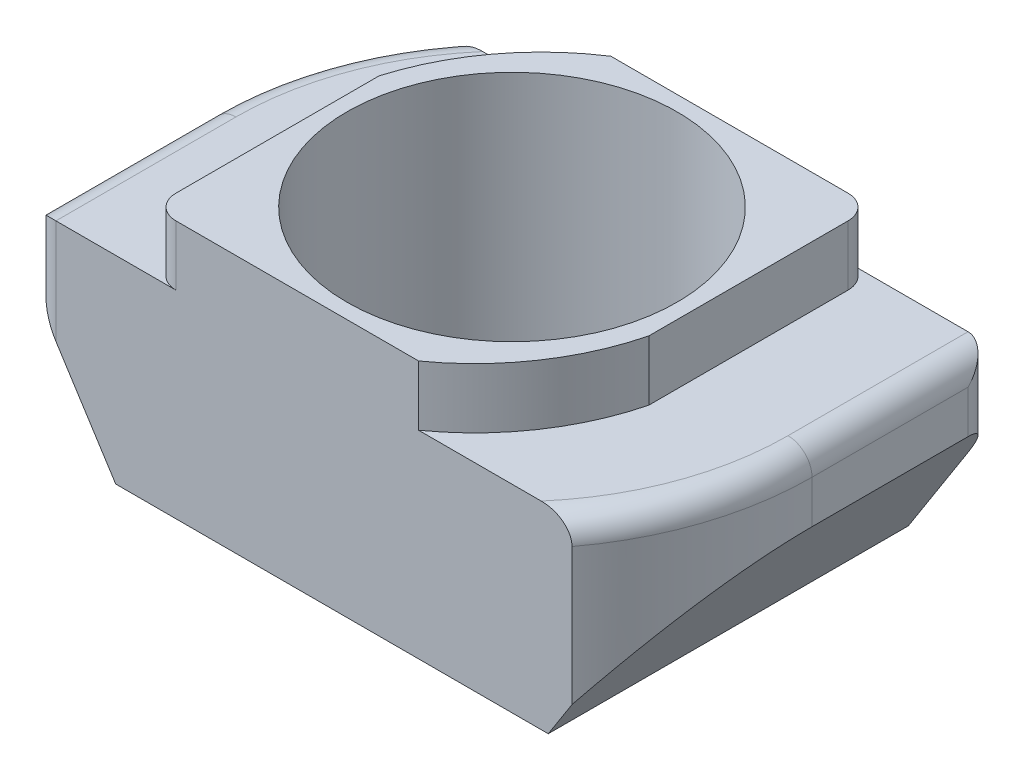
ISO-10303-21;
HEADER;
FILE_DESCRIPTION(('STEP AP214'),'2;1');
FILE_NAME('part.step','',(''),(''),'','','');
FILE_SCHEMA(('AUTOMOTIVE_DESIGN { 1 0 10303 214 1 1 1 1 }'));
ENDSEC;
DATA;
#1=APPLICATION_CONTEXT('core data for automotive mechanical design processes');
#2=APPLICATION_PROTOCOL_DEFINITION('international standard','automotive_design',2000,#1);
#3=PRODUCT_CONTEXT('',#1,'mechanical');
#4=PRODUCT('Part','Part','',(#3));
#5=PRODUCT_RELATED_PRODUCT_CATEGORY('part','',(#4));
#6=PRODUCT_DEFINITION_FORMATION('','',#4);
#7=PRODUCT_DEFINITION_CONTEXT('part definition',#1,'design');
#8=PRODUCT_DEFINITION('design','',#6,#7);
#9=PRODUCT_DEFINITION_SHAPE('','',#8);
#10=(LENGTH_UNIT() NAMED_UNIT(*) SI_UNIT(.MILLI.,.METRE.));
#11=(NAMED_UNIT(*) PLANE_ANGLE_UNIT() SI_UNIT($,.RADIAN.));
#12=(NAMED_UNIT(*) SI_UNIT($,.STERADIAN.) SOLID_ANGLE_UNIT());
#13=UNCERTAINTY_MEASURE_WITH_UNIT(LENGTH_MEASURE(1.E-05),#10,'distance_accuracy_value','');
#14=(GEOMETRIC_REPRESENTATION_CONTEXT(3) GLOBAL_UNCERTAINTY_ASSIGNED_CONTEXT((#13)) GLOBAL_UNIT_ASSIGNED_CONTEXT((#10,
#11,#12)) REPRESENTATION_CONTEXT('',''));
#15=CARTESIAN_POINT('',(0.,0.,0.));
#16=DIRECTION('',(0.,0.,1.));
#17=DIRECTION('',(1.,0.,0.));
#18=AXIS2_PLACEMENT_3D('',#15,#16,#17);
#19=CARTESIAN_POINT('',(0.,3.3,0.));
#20=DIRECTION('',(0.,1.,0.));
#21=DIRECTION('',(0.,0.,1.));
#22=AXIS2_PLACEMENT_3D('',#19,#20,#21);
#23=PLANE('',#22);
#24=DIRECTION('',(1.,0.,0.));
#25=VECTOR('',#24,1.);
#26=CARTESIAN_POINT('',(-5.,3.3,3.));
#27=LINE('',#26,#25);
#28=CARTESIAN_POINT('',(1.44349602110728,3.3,3.00000000000006));
#29=VERTEX_POINT('',#28);
#30=CARTESIAN_POINT('',(3.48711915483249,3.3,3.00000000000008));
#31=VERTEX_POINT('',#30);
#32=EDGE_CURVE('E427',#29,#31,#27,.T.);
#33=ORIENTED_EDGE('',*,*,#32,.T.);
#34=CARTESIAN_POINT('',(0.,3.3,0.));
#35=DIRECTION('',(0.,1.,0.));
#36=DIRECTION('',(0.,0.,1.));
#37=AXIS2_PLACEMENT_3D('',#34,#35,#36);
#38=CIRCLE('',#37,4.60000000000001);
#39=CARTESIAN_POINT('',(4.6,3.3,4.66476076092742E-07));
#40=VERTEX_POINT('',#39);
#41=EDGE_CURVE('E236',#31,#40,#38,.T.);
#42=ORIENTED_EDGE('',*,*,#41,.T.);
#43=DIRECTION('',(0.,0.,-1.));
#44=VECTOR('',#43,1.);
#45=CARTESIAN_POINT('',(4.6,3.3,-3.));
#46=LINE('',#45,#44);
#47=CARTESIAN_POINT('',(4.6,3.3,-3.));
#48=VERTEX_POINT('',#47);
#49=EDGE_CURVE('E234',#40,#48,#46,.T.);
#50=ORIENTED_EDGE('',*,*,#49,.T.);
#51=DIRECTION('',(-1.,0.,0.));
#52=VECTOR('',#51,1.);
#53=CARTESIAN_POINT('',(-4.,3.3,-3.));
#54=LINE('',#53,#52);
#55=CARTESIAN_POINT('',(2.6,3.3,-3.));
#56=VERTEX_POINT('',#55);
#57=EDGE_CURVE('E341',#48,#56,#54,.T.);
#58=ORIENTED_EDGE('',*,*,#57,.T.);
#59=CARTESIAN_POINT('',(2.6,3.3,-2.6));
#60=DIRECTION('',(0.,1.,0.));
#61=DIRECTION('',(0.,0.,1.));
#62=AXIS2_PLACEMENT_3D('',#59,#60,#61);
#63=CIRCLE('',#62,0.4);
#64=CARTESIAN_POINT('',(3.,3.3,-2.6));
#65=VERTEX_POINT('',#64);
#66=EDGE_CURVE('E52',#56,#65,#63,.F.);
#67=ORIENTED_EDGE('',*,*,#66,.T.);
#68=DIRECTION('',(0.,0.,-1.));
#69=VECTOR('',#68,1.);
#70=CARTESIAN_POINT('',(3.,3.3,0.720482929322957));
#71=LINE('',#70,#69);
#72=CARTESIAN_POINT('',(3.,3.3,0.720482929322956));
#73=VERTEX_POINT('',#72);
#74=EDGE_CURVE('E399',#73,#65,#71,.T.);
#75=ORIENTED_EDGE('',*,*,#74,.F.);
#76=CARTESIAN_POINT('',(-0.878763879453648,3.3,-0.256855685204119));
#77=DIRECTION('',(0.,1.,0.));
#78=DIRECTION('',(0.,0.,-1.));
#79=AXIS2_PLACEMENT_3D('',#76,#77,#78);
#80=CIRCLE('',#79,4.);
#81=EDGE_CURVE('E404',#29,#73,#80,.T.);
#82=ORIENTED_EDGE('',*,*,#81,.F.);
#83=EDGE_LOOP('',(#33,#42,#50,#58,#67,#75,#82));
#84=FACE_BOUND('',#83,.T.);
#85=ADVANCED_FACE('F43',(#84),#23,.T.);
#86=CARTESIAN_POINT('',(5.,3.3,5.07039213178777E-07));
#87=DIRECTION('',(-1.,0.,0.));
#88=DIRECTION('',(0.,0.,1.));
#89=AXIS2_PLACEMENT_3D('',#86,#87,#88);
#90=PLANE('',#89);
#91=DIRECTION('',(0.,-1.,0.));
#92=VECTOR('',#91,1.);
#93=CARTESIAN_POINT('',(5.,3.3,-2.6));
#94=LINE('',#93,#92);
#95=CARTESIAN_POINT('',(5.,2.1859942265565,-2.6));
#96=VERTEX_POINT('',#95);
#97=CARTESIAN_POINT('',(5.,2.9,-2.6));
#98=VERTEX_POINT('',#97);
#99=EDGE_CURVE('E288',#96,#98,#94,.F.);
#100=ORIENTED_EDGE('',*,*,#99,.T.);
#101=DIRECTION('',(0.,0.,-1.));
#102=VECTOR('',#101,1.);
#103=CARTESIAN_POINT('',(5.,2.9,5.07039213144285E-07));
#104=LINE('',#103,#102);
#105=CARTESIAN_POINT('',(4.99999999999999,2.9,5.07039213144285E-07));
#106=VERTEX_POINT('',#105);
#107=EDGE_CURVE('E447',#98,#106,#104,.F.);
#108=ORIENTED_EDGE('',*,*,#107,.T.);
#109=DIRECTION('',(0.,-1.,0.));
#110=VECTOR('',#109,1.);
#111=CARTESIAN_POINT('',(4.99999999999999,3.3,5.07039213144285E-07));
#112=LINE('',#111,#110);
#113=CARTESIAN_POINT('',(5.,2.1859942265565,0.));
#114=VERTEX_POINT('',#113);
#115=EDGE_CURVE('E225',#106,#114,#112,.T.);
#116=ORIENTED_EDGE('',*,*,#115,.T.);
#117=DIRECTION('',(0.,0.,1.));
#118=VECTOR('',#117,1.);
#119=CARTESIAN_POINT('',(5.,2.1859942265565,-3.));
#120=LINE('',#119,#118);
#121=EDGE_CURVE('E197',#96,#114,#120,.T.);
#122=ORIENTED_EDGE('',*,*,#121,.F.);
#123=EDGE_LOOP('',(#100,#108,#116,#122));
#124=FACE_BOUND('',#123,.T.);
#125=ADVANCED_FACE('F278',(#124),#90,.F.);
#126=CARTESIAN_POINT('',(-4.,3.3,-3.));
#127=DIRECTION('',(0.,0.,1.));
#128=DIRECTION('',(1.,0.,0.));
#129=AXIS2_PLACEMENT_3D('',#126,#127,#128);
#130=PLANE('',#129);
#131=DIRECTION('',(0.,-1.,0.));
#132=VECTOR('',#131,1.);
#133=CARTESIAN_POINT('',(-4.,3.3,-3.));
#134=LINE('',#133,#132);
#135=CARTESIAN_POINT('',(-4.,2.9,-3.));
#136=VERTEX_POINT('',#135);
#137=CARTESIAN_POINT('',(-4.00000000000002,0.619916529491348,-3.));
#138=VERTEX_POINT('',#137);
#139=EDGE_CURVE('E232',#136,#138,#134,.T.);
#140=ORIENTED_EDGE('',*,*,#139,.F.);
#141=CARTESIAN_POINT('',(-4.00000000000001,2.9,-3.00000000000001));
#142=CARTESIAN_POINT('',(-4.00003431403493,2.91925089990377,-3.));
#143=CARTESIAN_POINT('',(-3.99826537820566,2.93847244745864,-3.));
#144=CARTESIAN_POINT('',(-3.99140482228532,2.97620489427299,-3.));
#145=CARTESIAN_POINT('',(-3.98633215027465,2.99471921255593,-3.));
#146=CARTESIAN_POINT('',(-3.97315149911917,3.03059125297224,-3.));
#147=CARTESIAN_POINT('',(-3.96504779352722,3.04795056318892,-3.));
#148=CARTESIAN_POINT('',(-3.94621525075523,3.08119322758857,-3.));
#149=CARTESIAN_POINT('',(-3.93548326398388,3.09707477915996,-3.));
#150=CARTESIAN_POINT('',(-3.91106255079307,3.12809633983386,-3.));
#151=CARTESIAN_POINT('',(-3.8972260366212,3.1431193428702,-3.));
#152=CARTESIAN_POINT('',(-3.86759474786736,3.17106822334778,-3.));
#153=CARTESIAN_POINT('',(-3.85179957521133,3.18399367324987,-3.));
#154=CARTESIAN_POINT('',(-3.8111515495217,3.21312382777033,-3.));
#155=CARTESIAN_POINT('',(-3.7854469871541,3.22814543676558,-3.));
#156=CARTESIAN_POINT('',(-3.7318833976761,3.25382794362572,-3.));
#157=CARTESIAN_POINT('',(-3.70401711650112,3.26447333092222,-3.));
#158=CARTESIAN_POINT('',(-3.64491759073711,3.28220138807193,-3.));
#159=CARTESIAN_POINT('',(-3.61358825887351,3.288958984584,-3.));
#160=CARTESIAN_POINT('',(-3.55052326243339,3.29783535209871,-3.));
#161=CARTESIAN_POINT('',(-3.51879275013065,3.29999028258924,-3.));
#162=CARTESIAN_POINT('',(-3.48711915483256,3.3,-3.));
#163=B_SPLINE_CURVE_WITH_KNOTS('',3,(#141,#142,#143,#144,#145,#146,#147,#148,#149,#150,#151,
#152,#153,#154,#155,#156,#157,#158,#159,#160,#161,#162),.UNSPECIFIED.,.F.,.F.,(4,2,2,2,2,2,2,2,
2,2,4),(0.,0.0576252653148898,0.114922906005126,0.17214006356257,0.229426125512933,
0.290470494707397,0.3515272908414,0.440359640082766,0.529504176823678,0.62529978442515,
0.72033999102425),.UNSPECIFIED.);
#164=CARTESIAN_POINT('',(-3.48711915483256,3.3,-3.));
#165=VERTEX_POINT('',#164);
#166=EDGE_CURVE('E280',#136,#165,#163,.T.);
#167=ORIENTED_EDGE('',*,*,#166,.T.);
#168=CARTESIAN_POINT('',(-1.35239697550827,3.3,-3.));
#169=VERTEX_POINT('',#168);
#170=EDGE_CURVE('E216',#169,#165,#54,.T.);
#171=ORIENTED_EDGE('',*,*,#170,.F.);
#172=DIRECTION('',(0.,-1.,0.));
#173=VECTOR('',#172,1.);
#174=CARTESIAN_POINT('',(-1.35239697550827,4.3,-3.));
#175=LINE('',#174,#173);
#176=CARTESIAN_POINT('',(-1.35239697550827,4.3,-3.));
#177=VERTEX_POINT('',#176);
#178=EDGE_CURVE('E214',#177,#169,#175,.T.);
#179=ORIENTED_EDGE('',*,*,#178,.F.);
#180=DIRECTION('',(-1.,0.,0.));
#181=VECTOR('',#180,1.);
#182=CARTESIAN_POINT('',(-1.35239697550827,4.3,-3.));
#183=LINE('',#182,#181);
#184=CARTESIAN_POINT('',(2.6,4.3,-3.));
#185=VERTEX_POINT('',#184);
#186=EDGE_CURVE('E353',#185,#177,#183,.T.);
#187=ORIENTED_EDGE('',*,*,#186,.F.);
#188=DIRECTION('',(0.,-1.,0.));
#189=VECTOR('',#188,1.);
#190=CARTESIAN_POINT('',(2.6,3.3,-3.));
#191=LINE('',#190,#189);
#192=EDGE_CURVE('E348',#185,#56,#191,.T.);
#193=ORIENTED_EDGE('',*,*,#192,.T.);
#194=ORIENTED_EDGE('',*,*,#57,.F.);
#195=DIRECTION('',(0.,-1.,0.));
#196=VECTOR('',#195,1.);
#197=CARTESIAN_POINT('',(4.6,3.3,-3.));
#198=LINE('',#197,#196);
#199=CARTESIAN_POINT('',(4.6,1.55956314773042,-3.));
#200=VERTEX_POINT('',#199);
#201=EDGE_CURVE('E194',#48,#200,#198,.T.);
#202=ORIENTED_EDGE('',*,*,#201,.T.);
#203=DIRECTION('',(-0.538179198515183,-0.84283043981904,0.));
#204=VECTOR('',#203,1.);
#205=CARTESIAN_POINT('',(5.,2.1859942265565,-3.));
#206=LINE('',#205,#204);
#207=CARTESIAN_POINT('',(3.60415978680174,0.,-3.));
#208=VERTEX_POINT('',#207);
#209=EDGE_CURVE('E185',#200,#208,#206,.T.);
#210=ORIENTED_EDGE('',*,*,#209,.T.);
#211=DIRECTION('',(-1.,0.,0.));
#212=VECTOR('',#211,1.);
#213=CARTESIAN_POINT('',(-4.,0.,-3.));
#214=LINE('',#213,#212);
#215=CARTESIAN_POINT('',(-3.60415978680174,0.,-3.));
#216=VERTEX_POINT('',#215);
#217=EDGE_CURVE('E191',#208,#216,#214,.T.);
#218=ORIENTED_EDGE('',*,*,#217,.T.);
#219=DIRECTION('',(-0.538179198515183,0.84283043981904,0.));
#220=VECTOR('',#219,1.);
#221=CARTESIAN_POINT('',(-5.,2.1859942265565,-3.));
#222=LINE('',#221,#220);
#223=EDGE_CURVE('E382',#216,#138,#222,.T.);
#224=ORIENTED_EDGE('',*,*,#223,.T.);
#225=EDGE_LOOP('',(#140,#167,#171,#179,#187,#193,#194,#202,#210,#218,#224));
#226=FACE_BOUND('',#225,.T.);
#227=ADVANCED_FACE('F188',(#226),#130,.F.);
#228=CARTESIAN_POINT('',(0.,3.3,0.));
#229=DIRECTION('',(0.,-1.,0.));
#230=DIRECTION('',(0.,0.,-1.));
#231=AXIS2_PLACEMENT_3D('',#228,#229,#230);
#232=CYLINDRICAL_SURFACE('',#231,5.00000000000001);
#233=DIRECTION('',(0.,-1.,0.));
#234=VECTOR('',#233,1.);
#235=CARTESIAN_POINT('',(-4.99999999999999,3.3,-5.07039215977055E-07));
#236=LINE('',#235,#234);
#237=CARTESIAN_POINT('',(-4.99999999999999,2.9,-5.07039215977055E-07));
#238=VERTEX_POINT('',#237);
#239=CARTESIAN_POINT('',(-5.,2.1859942265565,-5.07039215735111E-07));
#240=VERTEX_POINT('',#239);
#241=EDGE_CURVE('E230',#238,#240,#236,.T.);
#242=ORIENTED_EDGE('',*,*,#241,.F.);
#243=CARTESIAN_POINT('',(0.,2.9,0.));
#244=DIRECTION('',(0.,1.,0.));
#245=DIRECTION('',(0.,0.,1.));
#246=AXIS2_PLACEMENT_3D('',#243,#244,#245);
#247=CIRCLE('',#246,5.00000000000001);
#248=EDGE_CURVE('E347',#238,#136,#247,.F.);
#249=ORIENTED_EDGE('',*,*,#248,.T.);
#250=ORIENTED_EDGE('',*,*,#139,.T.);
#251=CARTESIAN_POINT('',(0.,-5.64439425876938,0.));
#252=DIRECTION('',(0.842830439819039,0.538179198515183,0.));
#253=DIRECTION('',(0.538179198515183,-0.84283043981904,0.));
#254=AXIS2_PLACEMENT_3D('',#251,#252,#253);
#255=ELLIPSE('',#254,9.29058576361709,5.00000000000001);
#256=EDGE_CURVE('E208',#138,#240,#255,.T.);
#257=ORIENTED_EDGE('',*,*,#256,.T.);
#258=EDGE_LOOP('',(#242,#249,#250,#257));
#259=FACE_BOUND('',#258,.T.);
#260=ADVANCED_FACE('F271',(#259),#232,.T.);
#261=CARTESIAN_POINT('',(-5.,3.3,3.));
#262=DIRECTION('',(1.,0.,0.));
#263=DIRECTION('',(0.,0.,-1.));
#264=AXIS2_PLACEMENT_3D('',#261,#262,#263);
#265=PLANE('',#264);
#266=DIRECTION('',(0.,-1.,0.));
#267=VECTOR('',#266,1.);
#268=CARTESIAN_POINT('',(-5.,3.3,2.6));
#269=LINE('',#268,#267);
#270=CARTESIAN_POINT('',(-5.,2.1859942265565,2.6));
#271=VERTEX_POINT('',#270);
#272=CARTESIAN_POINT('',(-5.,2.9,2.6));
#273=VERTEX_POINT('',#272);
#274=EDGE_CURVE('E371',#271,#273,#269,.F.);
#275=ORIENTED_EDGE('',*,*,#274,.T.);
#276=DIRECTION('',(0.,0.,1.));
#277=VECTOR('',#276,1.);
#278=CARTESIAN_POINT('',(-5.,2.9,-5.07039215977055E-07));
#279=LINE('',#278,#277);
#280=EDGE_CURVE('E367',#273,#238,#279,.F.);
#281=ORIENTED_EDGE('',*,*,#280,.T.);
#282=ORIENTED_EDGE('',*,*,#241,.T.);
#283=DIRECTION('',(0.,0.,1.));
#284=VECTOR('',#283,1.);
#285=CARTESIAN_POINT('',(-5.,2.1859942265565,-3.));
#286=LINE('',#285,#284);
#287=EDGE_CURVE('E385',#240,#271,#286,.T.);
#288=ORIENTED_EDGE('',*,*,#287,.T.);
#289=EDGE_LOOP('',(#275,#281,#282,#288));
#290=FACE_BOUND('',#289,.T.);
#291=ADVANCED_FACE('F266',(#290),#265,.F.);
#292=CARTESIAN_POINT('',(-5.,3.3,3.));
#293=DIRECTION('',(0.,0.,-1.));
#294=DIRECTION('',(-1.,0.,0.));
#295=AXIS2_PLACEMENT_3D('',#292,#293,#294);
#296=PLANE('',#295);
#297=DIRECTION('',(0.,-1.,0.));
#298=VECTOR('',#297,1.);
#299=CARTESIAN_POINT('',(3.99999999999994,3.3,3.00000000000008));
#300=LINE('',#299,#298);
#301=CARTESIAN_POINT('',(3.99999999999994,2.9,3.00000000000008));
#302=VERTEX_POINT('',#301);
#303=CARTESIAN_POINT('',(3.99999999999998,0.619916529491295,3.00000000000004));
#304=VERTEX_POINT('',#303);
#305=EDGE_CURVE('E228',#302,#304,#300,.T.);
#306=ORIENTED_EDGE('',*,*,#305,.F.);
#307=CARTESIAN_POINT('',(3.99999999999995,2.9,3.00000000000009));
#308=CARTESIAN_POINT('',(4.00003431403487,2.91925089990377,3.00000000000008));
#309=CARTESIAN_POINT('',(3.9982653782056,2.93847244745864,3.00000000000008));
#310=CARTESIAN_POINT('',(3.99140482228526,2.97620489427299,3.00000000000008));
#311=CARTESIAN_POINT('',(3.98633215027459,2.99471921255593,3.00000000000008));
#312=CARTESIAN_POINT('',(3.97315149911911,3.03059125297224,3.00000000000008));
#313=CARTESIAN_POINT('',(3.96504779352716,3.04795056318892,3.00000000000008));
#314=CARTESIAN_POINT('',(3.94621525075517,3.08119322758856,3.00000000000008));
#315=CARTESIAN_POINT('',(3.93548326398382,3.09707477915996,3.00000000000008));
#316=CARTESIAN_POINT('',(3.91106255079301,3.12809633983386,3.00000000000008));
#317=CARTESIAN_POINT('',(3.89722603662114,3.1431193428702,3.00000000000008));
#318=CARTESIAN_POINT('',(3.86759474786731,3.17106822334778,3.00000000000008));
#319=CARTESIAN_POINT('',(3.85179957521127,3.18399367324987,3.00000000000008));
#320=CARTESIAN_POINT('',(3.81115154952164,3.21312382777033,3.00000000000008));
#321=CARTESIAN_POINT('',(3.78544698715404,3.22814543676558,3.00000000000008));
#322=CARTESIAN_POINT('',(3.73188339767604,3.25382794362572,3.00000000000008));
#323=CARTESIAN_POINT('',(3.70401711650106,3.26447333092222,3.00000000000008));
#324=CARTESIAN_POINT('',(3.64491759073705,3.28220138807193,3.00000000000008));
#325=CARTESIAN_POINT('',(3.61358825887345,3.288958984584,3.00000000000008));
#326=CARTESIAN_POINT('',(3.55052326243332,3.29783535209871,3.00000000000008));
#327=CARTESIAN_POINT('',(3.51879275013058,3.29999028258924,3.00000000000008));
#328=CARTESIAN_POINT('',(3.48711915483249,3.3,3.00000000000008));
#329=B_SPLINE_CURVE_WITH_KNOTS('',3,(#307,#308,#309,#310,#311,#312,#313,#314,#315,#316,#317,
#318,#319,#320,#321,#322,#323,#324,#325,#326,#327,#328),.UNSPECIFIED.,.F.,.F.,(4,2,2,2,2,2,2,2,
2,2,4),(0.,0.0576252653148898,0.114922906005125,0.172140063562569,0.229426125512933,
0.290470494707397,0.351527290841399,0.440359640082765,0.529504176823678,0.625299784425152,
0.720339991024254),.UNSPECIFIED.);
#330=EDGE_CURVE('E246',#302,#31,#329,.T.);
#331=ORIENTED_EDGE('',*,*,#330,.T.);
#332=ORIENTED_EDGE('',*,*,#32,.F.);
#333=DIRECTION('',(0.,-1.,0.));
#334=VECTOR('',#333,1.);
#335=CARTESIAN_POINT('',(1.44349602110736,4.3,3.));
#336=LINE('',#335,#334);
#337=CARTESIAN_POINT('',(1.44349602110736,4.3,3.));
#338=VERTEX_POINT('',#337);
#339=EDGE_CURVE('E423',#338,#29,#336,.T.);
#340=ORIENTED_EDGE('',*,*,#339,.F.);
#341=DIRECTION('',(1.,0.,0.));
#342=VECTOR('',#341,1.);
#343=CARTESIAN_POINT('',(-3.,4.3,3.));
#344=LINE('',#343,#342);
#345=CARTESIAN_POINT('',(-2.6,4.3,3.));
#346=VERTEX_POINT('',#345);
#347=EDGE_CURVE('E410',#346,#338,#344,.T.);
#348=ORIENTED_EDGE('',*,*,#347,.F.);
#349=DIRECTION('',(0.,-1.,0.));
#350=VECTOR('',#349,1.);
#351=CARTESIAN_POINT('',(-2.6,3.3,3.00000000000002));
#352=LINE('',#351,#350);
#353=CARTESIAN_POINT('',(-2.6,3.3,3.00000000000002));
#354=VERTEX_POINT('',#353);
#355=EDGE_CURVE('E241',#346,#354,#352,.T.);
#356=ORIENTED_EDGE('',*,*,#355,.T.);
#357=CARTESIAN_POINT('',(-4.60000000000001,3.3,3.));
#358=VERTEX_POINT('',#357);
#359=EDGE_CURVE('E222',#358,#354,#27,.T.);
#360=ORIENTED_EDGE('',*,*,#359,.F.);
#361=DIRECTION('',(0.,-1.,0.));
#362=VECTOR('',#361,1.);
#363=CARTESIAN_POINT('',(-4.60000000000001,3.3,3.));
#364=LINE('',#363,#362);
#365=CARTESIAN_POINT('',(-4.60000000000001,1.55956314773044,3.00000000000004));
#366=VERTEX_POINT('',#365);
#367=EDGE_CURVE('E244',#358,#366,#364,.T.);
#368=ORIENTED_EDGE('',*,*,#367,.T.);
#369=DIRECTION('',(-0.538179198515183,0.84283043981904,0.));
#370=VECTOR('',#369,1.);
#371=CARTESIAN_POINT('',(-5.,2.1859942265565,3.00000000000004));
#372=LINE('',#371,#370);
#373=CARTESIAN_POINT('',(-3.60415978680174,0.,3.00000000000004));
#374=VERTEX_POINT('',#373);
#375=EDGE_CURVE('E377',#374,#366,#372,.T.);
#376=ORIENTED_EDGE('',*,*,#375,.F.);
#377=DIRECTION('',(1.,0.,0.));
#378=VECTOR('',#377,1.);
#379=CARTESIAN_POINT('',(-5.,0.,3.));
#380=LINE('',#379,#378);
#381=CARTESIAN_POINT('',(3.60415978680174,0.,3.00000000000008));
#382=VERTEX_POINT('',#381);
#383=EDGE_CURVE('E213',#374,#382,#380,.T.);
#384=ORIENTED_EDGE('',*,*,#383,.T.);
#385=DIRECTION('',(-0.538179198515183,-0.84283043981904,0.));
#386=VECTOR('',#385,1.);
#387=CARTESIAN_POINT('',(5.,2.1859942265565,3.00000000000004));
#388=LINE('',#387,#386);
#389=EDGE_CURVE('E198',#304,#382,#388,.T.);
#390=ORIENTED_EDGE('',*,*,#389,.F.);
#391=EDGE_LOOP('',(#306,#331,#332,#340,#348,#356,#360,#368,#376,#384,#390));
#392=FACE_BOUND('',#391,.T.);
#393=ADVANCED_FACE('F260',(#392),#296,.F.);
#394=CARTESIAN_POINT('',(0.,3.3,0.));
#395=DIRECTION('',(0.,-1.,0.));
#396=DIRECTION('',(0.,0.,-1.));
#397=AXIS2_PLACEMENT_3D('',#394,#395,#396);
#398=CYLINDRICAL_SURFACE('',#397,5.00000000000001);
#399=ORIENTED_EDGE('',*,*,#115,.F.);
#400=CARTESIAN_POINT('',(0.,2.9,0.));
#401=DIRECTION('',(0.,1.,0.));
#402=DIRECTION('',(0.,0.,1.));
#403=AXIS2_PLACEMENT_3D('',#400,#401,#402);
#404=CIRCLE('',#403,5.00000000000001);
#405=EDGE_CURVE('E239',#106,#302,#404,.F.);
#406=ORIENTED_EDGE('',*,*,#405,.T.);
#407=ORIENTED_EDGE('',*,*,#305,.T.);
#408=CARTESIAN_POINT('',(0.,-5.64439425876938,0.));
#409=DIRECTION('',(-0.842830439819039,0.538179198515183,0.));
#410=DIRECTION('',(-0.538179198515183,-0.84283043981904,0.));
#411=AXIS2_PLACEMENT_3D('',#408,#409,#410);
#412=ELLIPSE('',#411,9.29058576361709,5.00000000000001);
#413=EDGE_CURVE('E392',#304,#114,#412,.T.);
#414=ORIENTED_EDGE('',*,*,#413,.T.);
#415=EDGE_LOOP('',(#399,#406,#407,#414));
#416=FACE_BOUND('',#415,.T.);
#417=ADVANCED_FACE('F265',(#416),#398,.T.);
#418=ORIENTED_EDGE('',*,*,#170,.T.);
#419=CARTESIAN_POINT('',(0.,3.3,0.));
#420=DIRECTION('',(0.,1.,0.));
#421=DIRECTION('',(0.,0.,1.));
#422=AXIS2_PLACEMENT_3D('',#419,#420,#421);
#423=CIRCLE('',#422,4.60000000000001);
#424=CARTESIAN_POINT('',(-4.6,3.3,-4.6647607869889E-07));
#425=VERTEX_POINT('',#424);
#426=EDGE_CURVE('E337',#165,#425,#423,.T.);
#427=ORIENTED_EDGE('',*,*,#426,.T.);
#428=DIRECTION('',(0.,0.,1.));
#429=VECTOR('',#428,1.);
#430=CARTESIAN_POINT('',(-4.6,3.3,3.));
#431=LINE('',#430,#429);
#432=EDGE_CURVE('E254',#425,#358,#431,.T.);
#433=ORIENTED_EDGE('',*,*,#432,.T.);
#434=ORIENTED_EDGE('',*,*,#359,.T.);
#435=CARTESIAN_POINT('',(-2.6,3.3,2.60000000000002));
#436=DIRECTION('',(0.,1.,0.));
#437=DIRECTION('',(0.,0.,1.));
#438=AXIS2_PLACEMENT_3D('',#435,#436,#437);
#439=CIRCLE('',#438,0.4);
#440=CARTESIAN_POINT('',(-3.,3.3,2.60000000000002));
#441=VERTEX_POINT('',#440);
#442=EDGE_CURVE('E11',#354,#441,#439,.F.);
#443=ORIENTED_EDGE('',*,*,#442,.T.);
#444=DIRECTION('',(0.,0.,1.));
#445=VECTOR('',#444,1.);
#446=CARTESIAN_POINT('',(-3.,3.3,3.));
#447=LINE('',#446,#445);
#448=CARTESIAN_POINT('',(-3.,3.3,-0.785433002706308));
#449=VERTEX_POINT('',#448);
#450=EDGE_CURVE('E417',#449,#441,#447,.T.);
#451=ORIENTED_EDGE('',*,*,#450,.F.);
#452=CARTESIAN_POINT('',(0.835970797860175,3.3,0.348290084279205));
#453=DIRECTION('',(0.,1.,0.));
#454=DIRECTION('',(0.,0.,-1.));
#455=AXIS2_PLACEMENT_3D('',#452,#453,#454);
#456=CIRCLE('',#455,4.);
#457=EDGE_CURVE('E339',#169,#449,#456,.T.);
#458=ORIENTED_EDGE('',*,*,#457,.F.);
#459=EDGE_LOOP('',(#418,#427,#433,#434,#443,#451,#458));
#460=FACE_BOUND('',#459,.T.);
#461=ADVANCED_FACE('F316',(#460),#23,.T.);
#462=CARTESIAN_POINT('',(0.,0.,0.));
#463=DIRECTION('',(0.,1.,0.));
#464=DIRECTION('',(0.,0.,1.));
#465=AXIS2_PLACEMENT_3D('',#462,#463,#464);
#466=PLANE('',#465);
#467=CARTESIAN_POINT('',(0.,0.,0.));
#468=DIRECTION('',(0.,1.,0.));
#469=DIRECTION('',(0.,0.,1.));
#470=AXIS2_PLACEMENT_3D('',#467,#468,#469);
#471=CIRCLE('',#470,2.75);
#472=CARTESIAN_POINT('',(0.,0.,2.75));
#473=VERTEX_POINT('',#472);
#474=EDGE_CURVE('E396',#473,#473,#471,.T.);
#475=ORIENTED_EDGE('',*,*,#474,.T.);
#476=EDGE_LOOP('',(#475));
#477=FACE_BOUND('',#476,.T.);
#478=ORIENTED_EDGE('',*,*,#217,.F.);
#479=DIRECTION('',(0.,0.,1.));
#480=VECTOR('',#479,1.);
#481=CARTESIAN_POINT('',(3.60415978680174,0.,-3.));
#482=LINE('',#481,#480);
#483=EDGE_CURVE('E201',#208,#382,#482,.T.);
#484=ORIENTED_EDGE('',*,*,#483,.T.);
#485=ORIENTED_EDGE('',*,*,#383,.F.);
#486=DIRECTION('',(0.,0.,1.));
#487=VECTOR('',#486,1.);
#488=CARTESIAN_POINT('',(-3.60415978680174,0.,-3.));
#489=LINE('',#488,#487);
#490=EDGE_CURVE('E212',#216,#374,#489,.T.);
#491=ORIENTED_EDGE('',*,*,#490,.F.);
#492=EDGE_LOOP('',(#478,#484,#485,#491));
#493=FACE_BOUND('',#492,.T.);
#494=ADVANCED_FACE('F211',(#477,#493),#466,.F.);
#495=CARTESIAN_POINT('',(3.,4.3,0.720482929322957));
#496=DIRECTION('',(-1.,0.,0.));
#497=DIRECTION('',(0.,0.,1.));
#498=AXIS2_PLACEMENT_3D('',#495,#496,#497);
#499=PLANE('',#498);
#500=ORIENTED_EDGE('',*,*,#74,.T.);
#501=DIRECTION('',(0.,-1.,0.));
#502=VECTOR('',#501,1.);
#503=CARTESIAN_POINT('',(3.,4.3,-2.6));
#504=LINE('',#503,#502);
#505=CARTESIAN_POINT('',(3.,4.3,-2.6));
#506=VERTEX_POINT('',#505);
#507=EDGE_CURVE('E68',#65,#506,#504,.F.);
#508=ORIENTED_EDGE('',*,*,#507,.T.);
#509=DIRECTION('',(0.,0.,-1.));
#510=VECTOR('',#509,1.);
#511=CARTESIAN_POINT('',(3.,4.3,0.720482929322957));
#512=LINE('',#511,#510);
#513=CARTESIAN_POINT('',(3.,4.3,0.720482929322956));
#514=VERTEX_POINT('',#513);
#515=EDGE_CURVE('E402',#514,#506,#512,.T.);
#516=ORIENTED_EDGE('',*,*,#515,.F.);
#517=DIRECTION('',(0.,-1.,0.));
#518=VECTOR('',#517,1.);
#519=CARTESIAN_POINT('',(3.,4.3,0.720482929322956));
#520=LINE('',#519,#518);
#521=EDGE_CURVE('E414',#514,#73,#520,.T.);
#522=ORIENTED_EDGE('',*,*,#521,.T.);
#523=EDGE_LOOP('',(#500,#508,#516,#522));
#524=FACE_BOUND('',#523,.T.);
#525=ADVANCED_FACE('F330',(#524),#499,.F.);
#526=CARTESIAN_POINT('',(0.835970797860175,4.3,0.348290084279205));
#527=DIRECTION('',(0.,-1.,0.));
#528=DIRECTION('',(0.,0.,-1.));
#529=AXIS2_PLACEMENT_3D('',#526,#527,#528);
#530=CYLINDRICAL_SURFACE('',#529,4.);
#531=ORIENTED_EDGE('',*,*,#457,.T.);
#532=DIRECTION('',(0.,-1.,0.));
#533=VECTOR('',#532,1.);
#534=CARTESIAN_POINT('',(-3.,4.3,-0.785433002706308));
#535=LINE('',#534,#533);
#536=CARTESIAN_POINT('',(-3.,4.3,-0.785433002706308));
#537=VERTEX_POINT('',#536);
#538=EDGE_CURVE('E219',#537,#449,#535,.T.);
#539=ORIENTED_EDGE('',*,*,#538,.F.);
#540=CARTESIAN_POINT('',(0.835970797860175,4.3,0.348290084279205));
#541=DIRECTION('',(0.,1.,0.));
#542=DIRECTION('',(0.,0.,-1.));
#543=AXIS2_PLACEMENT_3D('',#540,#541,#542);
#544=CIRCLE('',#543,4.);
#545=EDGE_CURVE('E406',#177,#537,#544,.T.);
#546=ORIENTED_EDGE('',*,*,#545,.F.);
#547=ORIENTED_EDGE('',*,*,#178,.T.);
#548=EDGE_LOOP('',(#531,#539,#546,#547));
#549=FACE_BOUND('',#548,.T.);
#550=ADVANCED_FACE('F466',(#549),#530,.T.);
#551=CARTESIAN_POINT('',(-3.,4.3,3.));
#552=DIRECTION('',(1.,0.,0.));
#553=DIRECTION('',(0.,0.,-1.));
#554=AXIS2_PLACEMENT_3D('',#551,#552,#553);
#555=PLANE('',#554);
#556=ORIENTED_EDGE('',*,*,#450,.T.);
#557=DIRECTION('',(0.,-1.,0.));
#558=VECTOR('',#557,1.);
#559=CARTESIAN_POINT('',(-3.,4.3,2.60000000000002));
#560=LINE('',#559,#558);
#561=CARTESIAN_POINT('',(-3.,4.3,2.60000000000002));
#562=VERTEX_POINT('',#561);
#563=EDGE_CURVE('E60',#441,#562,#560,.F.);
#564=ORIENTED_EDGE('',*,*,#563,.T.);
#565=DIRECTION('',(0.,0.,1.));
#566=VECTOR('',#565,1.);
#567=CARTESIAN_POINT('',(-3.,4.3,3.));
#568=LINE('',#567,#566);
#569=EDGE_CURVE('E408',#537,#562,#568,.T.);
#570=ORIENTED_EDGE('',*,*,#569,.F.);
#571=ORIENTED_EDGE('',*,*,#538,.T.);
#572=EDGE_LOOP('',(#556,#564,#570,#571));
#573=FACE_BOUND('',#572,.T.);
#574=ADVANCED_FACE('F467',(#573),#555,.F.);
#575=CARTESIAN_POINT('',(-0.878763879453648,4.3,-0.256855685204119));
#576=DIRECTION('',(0.,-1.,0.));
#577=DIRECTION('',(0.,0.,-1.));
#578=AXIS2_PLACEMENT_3D('',#575,#576,#577);
#579=CYLINDRICAL_SURFACE('',#578,4.);
#580=ORIENTED_EDGE('',*,*,#81,.T.);
#581=ORIENTED_EDGE('',*,*,#521,.F.);
#582=CARTESIAN_POINT('',(-0.878763879453648,4.3,-0.256855685204119));
#583=DIRECTION('',(0.,1.,0.));
#584=DIRECTION('',(0.,0.,-1.));
#585=AXIS2_PLACEMENT_3D('',#582,#583,#584);
#586=CIRCLE('',#585,4.);
#587=EDGE_CURVE('E412',#338,#514,#586,.T.);
#588=ORIENTED_EDGE('',*,*,#587,.F.);
#589=ORIENTED_EDGE('',*,*,#339,.T.);
#590=EDGE_LOOP('',(#580,#581,#588,#589));
#591=FACE_BOUND('',#590,.T.);
#592=ADVANCED_FACE('F462',(#591),#579,.T.);
#593=CARTESIAN_POINT('',(0.835970797860175,4.3,0.348290084279205));
#594=DIRECTION('',(0.,-1.,0.));
#595=DIRECTION('',(0.,0.,-1.));
#596=AXIS2_PLACEMENT_3D('',#593,#594,#595);
#597=PLANE('',#596);
#598=CARTESIAN_POINT('',(0.,4.3,0.));
#599=DIRECTION('',(0.,1.,0.));
#600=DIRECTION('',(0.,0.,1.));
#601=AXIS2_PLACEMENT_3D('',#598,#599,#600);
#602=CIRCLE('',#601,2.75);
#603=CARTESIAN_POINT('',(0.,4.3,2.75));
#604=VERTEX_POINT('',#603);
#605=EDGE_CURVE('E395',#604,#604,#602,.T.);
#606=ORIENTED_EDGE('',*,*,#605,.F.);
#607=EDGE_LOOP('',(#606));
#608=FACE_BOUND('',#607,.T.);
#609=ORIENTED_EDGE('',*,*,#515,.T.);
#610=CARTESIAN_POINT('',(2.6,4.3,-2.6));
#611=DIRECTION('',(0.,-1.,0.));
#612=DIRECTION('',(0.,0.,-1.));
#613=AXIS2_PLACEMENT_3D('',#610,#611,#612);
#614=CIRCLE('',#613,0.4);
#615=EDGE_CURVE('E355',#506,#185,#614,.F.);
#616=ORIENTED_EDGE('',*,*,#615,.T.);
#617=ORIENTED_EDGE('',*,*,#186,.T.);
#618=ORIENTED_EDGE('',*,*,#545,.T.);
#619=ORIENTED_EDGE('',*,*,#569,.T.);
#620=CARTESIAN_POINT('',(-2.6,4.3,2.60000000000002));
#621=DIRECTION('',(0.,-1.,0.));
#622=DIRECTION('',(0.,0.,-1.));
#623=AXIS2_PLACEMENT_3D('',#620,#621,#622);
#624=CIRCLE('',#623,0.4);
#625=EDGE_CURVE('E439',#562,#346,#624,.F.);
#626=ORIENTED_EDGE('',*,*,#625,.T.);
#627=ORIENTED_EDGE('',*,*,#347,.T.);
#628=ORIENTED_EDGE('',*,*,#587,.T.);
#629=EDGE_LOOP('',(#609,#616,#617,#618,#619,#626,#627,#628));
#630=FACE_BOUND('',#629,.T.);
#631=ADVANCED_FACE('F437',(#608,#630),#597,.F.);
#632=CARTESIAN_POINT('',(0.,0.,0.));
#633=DIRECTION('',(0.,1.,0.));
#634=DIRECTION('',(0.,0.,1.));
#635=AXIS2_PLACEMENT_3D('',#632,#633,#634);
#636=CYLINDRICAL_SURFACE('',#635,2.75);
#637=ORIENTED_EDGE('',*,*,#474,.F.);
#638=EDGE_LOOP('',(#637));
#639=FACE_BOUND('',#638,.T.);
#640=ORIENTED_EDGE('',*,*,#605,.T.);
#641=EDGE_LOOP('',(#640));
#642=FACE_BOUND('',#641,.T.);
#643=ADVANCED_FACE('F511',(#639,#642),#636,.F.);
#644=CARTESIAN_POINT('',(-5.,2.1859942265565,-3.));
#645=DIRECTION('',(0.842830439819039,0.538179198515183,0.));
#646=DIRECTION('',(-0.538179198515183,0.84283043981904,0.));
#647=AXIS2_PLACEMENT_3D('',#644,#645,#646);
#648=PLANE('',#647);
#649=ORIENTED_EDGE('',*,*,#375,.T.);
#650=CARTESIAN_POINT('',(-4.6,1.55956314773043,2.6));
#651=DIRECTION('',(0.842830439819039,0.538179198515183,0.));
#652=DIRECTION('',(0.538179198515183,-0.84283043981904,0.));
#653=AXIS2_PLACEMENT_3D('',#650,#651,#652);
#654=ELLIPSE('',#653,0.743246861089366,0.4);
#655=EDGE_CURVE('E372',#366,#271,#654,.F.);
#656=ORIENTED_EDGE('',*,*,#655,.T.);
#657=ORIENTED_EDGE('',*,*,#287,.F.);
#658=ORIENTED_EDGE('',*,*,#256,.F.);
#659=ORIENTED_EDGE('',*,*,#223,.F.);
#660=ORIENTED_EDGE('',*,*,#490,.T.);
#661=EDGE_LOOP('',(#649,#656,#657,#658,#659,#660));
#662=FACE_BOUND('',#661,.T.);
#663=ADVANCED_FACE('F379',(#662),#648,.F.);
#664=CARTESIAN_POINT('',(5.,2.1859942265565,-3.));
#665=DIRECTION('',(-0.842830439819039,0.538179198515183,0.));
#666=DIRECTION('',(-0.538179198515183,-0.84283043981904,0.));
#667=AXIS2_PLACEMENT_3D('',#664,#665,#666);
#668=PLANE('',#667);
#669=ORIENTED_EDGE('',*,*,#209,.F.);
#670=CARTESIAN_POINT('',(4.6,1.55956314773042,-2.6));
#671=DIRECTION('',(-0.842830439819039,0.538179198515183,0.));
#672=DIRECTION('',(-0.538179198515183,-0.84283043981904,0.));
#673=AXIS2_PLACEMENT_3D('',#670,#671,#672);
#674=ELLIPSE('',#673,0.743246861089366,0.4);
#675=EDGE_CURVE('E444',#200,#96,#674,.F.);
#676=ORIENTED_EDGE('',*,*,#675,.T.);
#677=ORIENTED_EDGE('',*,*,#121,.T.);
#678=ORIENTED_EDGE('',*,*,#413,.F.);
#679=ORIENTED_EDGE('',*,*,#389,.T.);
#680=ORIENTED_EDGE('',*,*,#483,.F.);
#681=EDGE_LOOP('',(#669,#676,#677,#678,#679,#680));
#682=FACE_BOUND('',#681,.T.);
#683=ADVANCED_FACE('F202',(#682),#668,.F.);
#684=CARTESIAN_POINT('',(4.6,3.3,-2.6));
#685=DIRECTION('',(0.,-1.,0.));
#686=DIRECTION('',(0.,0.,-1.));
#687=AXIS2_PLACEMENT_3D('',#684,#685,#686);
#688=CYLINDRICAL_SURFACE('',#687,0.4);
#689=ORIENTED_EDGE('',*,*,#675,.F.);
#690=ORIENTED_EDGE('',*,*,#201,.F.);
#691=CARTESIAN_POINT('',(4.6,2.9,-2.6));
#692=DIRECTION('',(0.,-0.707106781186547,-0.707106781186547));
#693=DIRECTION('',(0.,-0.707106781186547,0.707106781186547));
#694=AXIS2_PLACEMENT_3D('',#691,#692,#693);
#695=ELLIPSE('',#694,0.565685424949238,0.4);
#696=EDGE_CURVE('E362',#98,#48,#695,.F.);
#697=ORIENTED_EDGE('',*,*,#696,.F.);
#698=ORIENTED_EDGE('',*,*,#99,.F.);
#699=EDGE_LOOP('',(#689,#690,#697,#698));
#700=FACE_BOUND('',#699,.T.);
#701=ADVANCED_FACE('F299',(#700),#688,.T.);
#702=CARTESIAN_POINT('',(4.6,2.9,0.));
#703=DIRECTION('',(0.,0.,1.));
#704=DIRECTION('',(1.,0.,0.));
#705=AXIS2_PLACEMENT_3D('',#702,#703,#704);
#706=CYLINDRICAL_SURFACE('',#705,0.4);
#707=ORIENTED_EDGE('',*,*,#696,.T.);
#708=ORIENTED_EDGE('',*,*,#49,.F.);
#709=CARTESIAN_POINT('',(4.6,2.9,5.0703921349123E-07));
#710=DIRECTION('',(0.,1.01407843496218E-07,0.999999999999995));
#711=DIRECTION('',(0.,-0.999999999999995,1.01407843496218E-07));
#712=AXIS2_PLACEMENT_3D('',#709,#710,#711);
#713=CIRCLE('',#712,0.4);
#714=EDGE_CURVE('E360',#106,#40,#713,.T.);
#715=ORIENTED_EDGE('',*,*,#714,.F.);
#716=ORIENTED_EDGE('',*,*,#107,.F.);
#717=EDGE_LOOP('',(#707,#708,#715,#716));
#718=FACE_BOUND('',#717,.T.);
#719=ADVANCED_FACE('F457',(#718),#706,.T.);
#720=CARTESIAN_POINT('',(0.,2.9,0.));
#721=DIRECTION('',(0.,1.,0.));
#722=DIRECTION('',(0.,0.,1.));
#723=AXIS2_PLACEMENT_3D('',#720,#721,#722);
#724=TOROIDAL_SURFACE('',#723,4.60000000000001,0.4);
#725=ORIENTED_EDGE('',*,*,#330,.F.);
#726=ORIENTED_EDGE('',*,*,#405,.F.);
#727=ORIENTED_EDGE('',*,*,#714,.T.);
#728=ORIENTED_EDGE('',*,*,#41,.F.);
#729=EDGE_LOOP('',(#725,#726,#727,#728));
#730=FACE_BOUND('',#729,.T.);
#731=ADVANCED_FACE('F256',(#730),#724,.T.);
#732=CARTESIAN_POINT('',(-4.6,3.3,2.6));
#733=DIRECTION('',(0.,-1.,0.));
#734=DIRECTION('',(0.,0.,-1.));
#735=AXIS2_PLACEMENT_3D('',#732,#733,#734);
#736=CYLINDRICAL_SURFACE('',#735,0.4);
#737=ORIENTED_EDGE('',*,*,#655,.F.);
#738=ORIENTED_EDGE('',*,*,#367,.F.);
#739=CARTESIAN_POINT('',(-4.6,2.9,2.6));
#740=DIRECTION('',(0.,-0.707106781186547,0.707106781186547));
#741=DIRECTION('',(0.,-0.707106781186547,-0.707106781186547));
#742=AXIS2_PLACEMENT_3D('',#739,#740,#741);
#743=ELLIPSE('',#742,0.565685424949238,0.4);
#744=EDGE_CURVE('E47',#273,#358,#743,.F.);
#745=ORIENTED_EDGE('',*,*,#744,.F.);
#746=ORIENTED_EDGE('',*,*,#274,.F.);
#747=EDGE_LOOP('',(#737,#738,#745,#746));
#748=FACE_BOUND('',#747,.T.);
#749=ADVANCED_FACE('F302',(#748),#736,.T.);
#750=CARTESIAN_POINT('',(-4.6,2.9,0.));
#751=DIRECTION('',(0.,0.,-1.));
#752=DIRECTION('',(-1.,0.,0.));
#753=AXIS2_PLACEMENT_3D('',#750,#751,#752);
#754=CYLINDRICAL_SURFACE('',#753,0.4);
#755=ORIENTED_EDGE('',*,*,#744,.T.);
#756=ORIENTED_EDGE('',*,*,#432,.F.);
#757=CARTESIAN_POINT('',(-4.6,2.9,-5.07039215745758E-07));
#758=DIRECTION('',(0.,1.01407842617169E-07,-0.999999999999995));
#759=DIRECTION('',(0.,0.999999999999995,1.01407842617169E-07));
#760=AXIS2_PLACEMENT_3D('',#757,#758,#759);
#761=CIRCLE('',#760,0.4);
#762=EDGE_CURVE('E345',#238,#425,#761,.T.);
#763=ORIENTED_EDGE('',*,*,#762,.F.);
#764=ORIENTED_EDGE('',*,*,#280,.F.);
#765=EDGE_LOOP('',(#755,#756,#763,#764));
#766=FACE_BOUND('',#765,.T.);
#767=ADVANCED_FACE('F297',(#766),#754,.T.);
#768=CARTESIAN_POINT('',(0.,2.9,0.));
#769=DIRECTION('',(0.,1.,0.));
#770=DIRECTION('',(0.,0.,1.));
#771=AXIS2_PLACEMENT_3D('',#768,#769,#770);
#772=TOROIDAL_SURFACE('',#771,4.60000000000001,0.4);
#773=ORIENTED_EDGE('',*,*,#166,.F.);
#774=ORIENTED_EDGE('',*,*,#248,.F.);
#775=ORIENTED_EDGE('',*,*,#762,.T.);
#776=ORIENTED_EDGE('',*,*,#426,.F.);
#777=EDGE_LOOP('',(#773,#774,#775,#776));
#778=FACE_BOUND('',#777,.T.);
#779=ADVANCED_FACE('F291',(#778),#772,.T.);
#780=CARTESIAN_POINT('',(2.6,3.3,-2.6));
#781=DIRECTION('',(0.,-1.,0.));
#782=DIRECTION('',(0.,0.,-1.));
#783=AXIS2_PLACEMENT_3D('',#780,#781,#782);
#784=CYLINDRICAL_SURFACE('',#783,0.4);
#785=ORIENTED_EDGE('',*,*,#615,.F.);
#786=ORIENTED_EDGE('',*,*,#507,.F.);
#787=ORIENTED_EDGE('',*,*,#66,.F.);
#788=ORIENTED_EDGE('',*,*,#192,.F.);
#789=EDGE_LOOP('',(#785,#786,#787,#788));
#790=FACE_BOUND('',#789,.T.);
#791=ADVANCED_FACE('F296',(#790),#784,.T.);
#792=CARTESIAN_POINT('',(-2.6,3.3,2.60000000000002));
#793=DIRECTION('',(0.,-1.,0.));
#794=DIRECTION('',(0.,0.,-1.));
#795=AXIS2_PLACEMENT_3D('',#792,#793,#794);
#796=CYLINDRICAL_SURFACE('',#795,0.4);
#797=ORIENTED_EDGE('',*,*,#625,.F.);
#798=ORIENTED_EDGE('',*,*,#563,.F.);
#799=ORIENTED_EDGE('',*,*,#442,.F.);
#800=ORIENTED_EDGE('',*,*,#355,.F.);
#801=EDGE_LOOP('',(#797,#798,#799,#800));
#802=FACE_BOUND('',#801,.T.);
#803=ADVANCED_FACE('F45',(#802),#796,.T.);
#804=CLOSED_SHELL('',(#85,#125,#227,#260,#291,#393,#417,#461,#494,#525,#550,#574,#592,#631,#643,
#663,#683,#701,#719,#731,#749,#767,#779,#791,#803));
#805=MANIFOLD_SOLID_BREP('B2',#804);
#806=ADVANCED_BREP_SHAPE_REPRESENTATION('',(#18,#805),#14);
#807=SHAPE_DEFINITION_REPRESENTATION(#9,#806);
ENDSEC;
END-ISO-10303-21;
